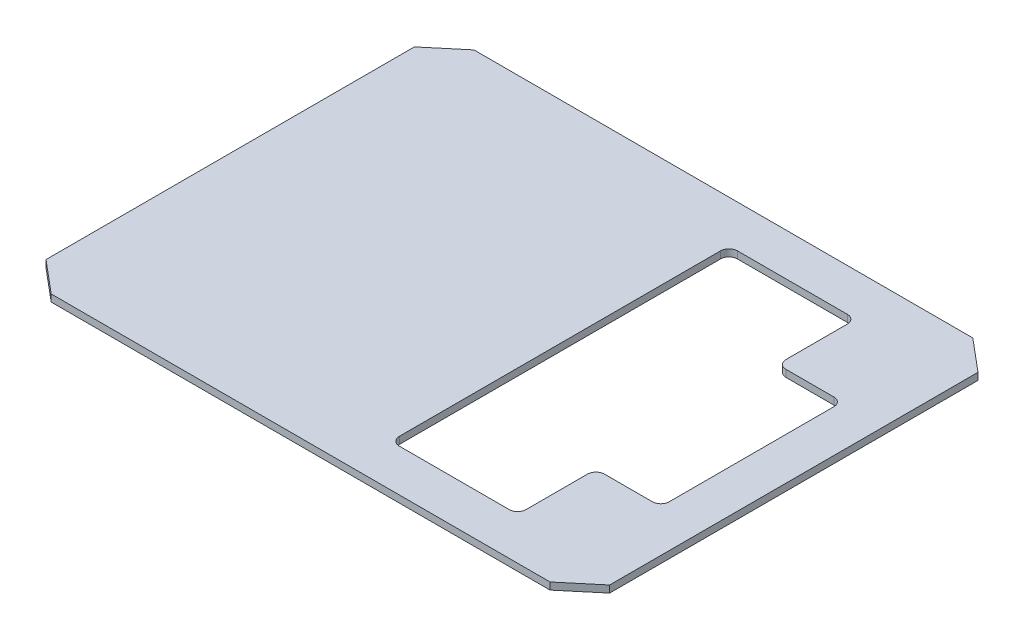
ISO-10303-21;
HEADER;
FILE_DESCRIPTION(('STEP AP214'),'2;1');
FILE_NAME('part.step','',(''),(''),'','','');
FILE_SCHEMA(('AUTOMOTIVE_DESIGN { 1 0 10303 214 1 1 1 1 }'));
ENDSEC;
DATA;
#1=APPLICATION_CONTEXT('core data for automotive mechanical design processes');
#2=APPLICATION_PROTOCOL_DEFINITION('international standard','automotive_design',2000,#1);
#3=PRODUCT_CONTEXT('',#1,'mechanical');
#4=PRODUCT('Part','Part','',(#3));
#5=PRODUCT_RELATED_PRODUCT_CATEGORY('part','',(#4));
#6=PRODUCT_DEFINITION_FORMATION('','',#4);
#7=PRODUCT_DEFINITION_CONTEXT('part definition',#1,'design');
#8=PRODUCT_DEFINITION('design','',#6,#7);
#9=PRODUCT_DEFINITION_SHAPE('','',#8);
#10=(LENGTH_UNIT() NAMED_UNIT(*) SI_UNIT(.MILLI.,.METRE.));
#11=(NAMED_UNIT(*) PLANE_ANGLE_UNIT() SI_UNIT($,.RADIAN.));
#12=(NAMED_UNIT(*) SI_UNIT($,.STERADIAN.) SOLID_ANGLE_UNIT());
#13=UNCERTAINTY_MEASURE_WITH_UNIT(LENGTH_MEASURE(1.E-05),#10,'distance_accuracy_value','');
#14=(GEOMETRIC_REPRESENTATION_CONTEXT(3) GLOBAL_UNCERTAINTY_ASSIGNED_CONTEXT((#13)) GLOBAL_UNIT_ASSIGNED_CONTEXT((#10,
#11,#12)) REPRESENTATION_CONTEXT('',''));
#15=CARTESIAN_POINT('',(0.,0.,0.));
#16=DIRECTION('',(0.,0.,1.));
#17=DIRECTION('',(1.,0.,0.));
#18=AXIS2_PLACEMENT_3D('',#15,#16,#17);
#19=CARTESIAN_POINT('',(127.,3.175,0.));
#20=DIRECTION('',(1.,0.,0.));
#21=DIRECTION('',(0.,0.,-1.));
#22=AXIS2_PLACEMENT_3D('',#19,#20,#21);
#23=PLANE('',#22);
#24=DIRECTION('',(0.,0.,1.));
#25=VECTOR('',#24,1.);
#26=CARTESIAN_POINT('',(127.,0.,0.));
#27=LINE('',#26,#25);
#28=CARTESIAN_POINT('',(127.,0.,-83.0048960354714));
#29=VERTEX_POINT('',#28);
#30=CARTESIAN_POINT('',(127.,0.,83.0048960354715));
#31=VERTEX_POINT('',#30);
#32=EDGE_CURVE('E299',#29,#31,#27,.T.);
#33=ORIENTED_EDGE('',*,*,#32,.F.);
#34=DIRECTION('',(0.,-1.,0.));
#35=VECTOR('',#34,1.);
#36=CARTESIAN_POINT('',(127.,3.175,-83.0048960354714));
#37=LINE('',#36,#35);
#38=CARTESIAN_POINT('',(127.,3.175,-83.0048960354714));
#39=VERTEX_POINT('',#38);
#40=EDGE_CURVE('E11',#39,#29,#37,.T.);
#41=ORIENTED_EDGE('',*,*,#40,.F.);
#42=DIRECTION('',(0.,0.,1.));
#43=VECTOR('',#42,1.);
#44=CARTESIAN_POINT('',(127.,3.175,0.));
#45=LINE('',#44,#43);
#46=CARTESIAN_POINT('',(127.,3.175,83.0048960354715));
#47=VERTEX_POINT('',#46);
#48=EDGE_CURVE('E327',#39,#47,#45,.T.);
#49=ORIENTED_EDGE('',*,*,#48,.T.);
#50=DIRECTION('',(0.,-1.,0.));
#51=VECTOR('',#50,1.);
#52=CARTESIAN_POINT('',(127.,3.175,83.0048960354715));
#53=LINE('',#52,#51);
#54=EDGE_CURVE('E350',#47,#31,#53,.T.);
#55=ORIENTED_EDGE('',*,*,#54,.T.);
#56=EDGE_LOOP('',(#33,#41,#49,#55));
#57=FACE_BOUND('',#56,.T.);
#58=ADVANCED_FACE('F35',(#57),#23,.T.);
#59=CARTESIAN_POINT('',(93.3452732950022,3.175,-111.244564801007));
#60=DIRECTION('',(-0.642787609686539,0.,0.766044443118978));
#61=DIRECTION('',(0.766044443118978,0.,0.642787609686539));
#62=AXIS2_PLACEMENT_3D('',#59,#60,#61);
#63=PLANE('',#62);
#64=DIRECTION('',(-0.766044443118978,0.,-0.642787609686539));
#65=VECTOR('',#64,1.);
#66=CARTESIAN_POINT('',(93.3452732950022,0.,-111.244564801007));
#67=LINE('',#66,#65);
#68=CARTESIAN_POINT('',(112.406853358583,0.,-95.25));
#69=VERTEX_POINT('',#68);
#70=EDGE_CURVE('E353',#29,#69,#67,.T.);
#71=ORIENTED_EDGE('',*,*,#70,.T.);
#72=DIRECTION('',(0.,-1.,0.));
#73=VECTOR('',#72,1.);
#74=CARTESIAN_POINT('',(112.406853358583,3.175,-95.25));
#75=LINE('',#74,#73);
#76=CARTESIAN_POINT('',(112.406853358583,3.175,-95.25));
#77=VERTEX_POINT('',#76);
#78=EDGE_CURVE('E42',#77,#69,#75,.T.);
#79=ORIENTED_EDGE('',*,*,#78,.F.);
#80=DIRECTION('',(-0.766044443118978,0.,-0.642787609686539));
#81=VECTOR('',#80,1.);
#82=CARTESIAN_POINT('',(93.3452732950022,3.175,-111.244564801007));
#83=LINE('',#82,#81);
#84=EDGE_CURVE('E330',#39,#77,#83,.T.);
#85=ORIENTED_EDGE('',*,*,#84,.F.);
#86=ORIENTED_EDGE('',*,*,#40,.T.);
#87=EDGE_LOOP('',(#71,#79,#85,#86));
#88=FACE_BOUND('',#87,.T.);
#89=ADVANCED_FACE('F391',(#88),#63,.F.);
#90=CARTESIAN_POINT('',(0.,3.175,-95.25));
#91=DIRECTION('',(0.,0.,-1.));
#92=DIRECTION('',(-1.,0.,0.));
#93=AXIS2_PLACEMENT_3D('',#90,#91,#92);
#94=PLANE('',#93);
#95=DIRECTION('',(1.,0.,0.));
#96=VECTOR('',#95,1.);
#97=CARTESIAN_POINT('',(0.,0.,-95.25));
#98=LINE('',#97,#96);
#99=CARTESIAN_POINT('',(-112.406853358583,0.,-95.25));
#100=VERTEX_POINT('',#99);
#101=EDGE_CURVE('E356',#100,#69,#98,.T.);
#102=ORIENTED_EDGE('',*,*,#101,.F.);
#103=DIRECTION('',(0.,-1.,0.));
#104=VECTOR('',#103,1.);
#105=CARTESIAN_POINT('',(-112.406853358583,3.175,-95.25));
#106=LINE('',#105,#104);
#107=CARTESIAN_POINT('',(-112.406853358583,3.175,-95.25));
#108=VERTEX_POINT('',#107);
#109=EDGE_CURVE('E382',#108,#100,#106,.T.);
#110=ORIENTED_EDGE('',*,*,#109,.F.);
#111=DIRECTION('',(1.,0.,0.));
#112=VECTOR('',#111,1.);
#113=CARTESIAN_POINT('',(0.,3.175,-95.25));
#114=LINE('',#113,#112);
#115=EDGE_CURVE('E333',#108,#77,#114,.T.);
#116=ORIENTED_EDGE('',*,*,#115,.T.);
#117=ORIENTED_EDGE('',*,*,#78,.T.);
#118=EDGE_LOOP('',(#102,#110,#116,#117));
#119=FACE_BOUND('',#118,.T.);
#120=ADVANCED_FACE('F386',(#119),#94,.T.);
#121=CARTESIAN_POINT('',(-93.3452732950022,3.175,-111.244564801007));
#122=DIRECTION('',(-0.642787609686539,0.,-0.766044443118978));
#123=DIRECTION('',(-0.766044443118978,0.,0.642787609686539));
#124=AXIS2_PLACEMENT_3D('',#121,#122,#123);
#125=PLANE('',#124);
#126=DIRECTION('',(0.766044443118978,0.,-0.642787609686539));
#127=VECTOR('',#126,1.);
#128=CARTESIAN_POINT('',(-93.3452732950022,0.,-111.244564801007));
#129=LINE('',#128,#127);
#130=CARTESIAN_POINT('',(-127.,0.,-83.0048960354714));
#131=VERTEX_POINT('',#130);
#132=EDGE_CURVE('E359',#131,#100,#129,.T.);
#133=ORIENTED_EDGE('',*,*,#132,.F.);
#134=DIRECTION('',(0.,-1.,0.));
#135=VECTOR('',#134,1.);
#136=CARTESIAN_POINT('',(-127.,3.175,-83.0048960354714));
#137=LINE('',#136,#135);
#138=CARTESIAN_POINT('',(-127.,3.175,-83.0048960354714));
#139=VERTEX_POINT('',#138);
#140=EDGE_CURVE('E380',#139,#131,#137,.T.);
#141=ORIENTED_EDGE('',*,*,#140,.F.);
#142=DIRECTION('',(0.766044443118978,0.,-0.642787609686539));
#143=VECTOR('',#142,1.);
#144=CARTESIAN_POINT('',(-93.3452732950022,3.175,-111.244564801007));
#145=LINE('',#144,#143);
#146=EDGE_CURVE('E336',#139,#108,#145,.T.);
#147=ORIENTED_EDGE('',*,*,#146,.T.);
#148=ORIENTED_EDGE('',*,*,#109,.T.);
#149=EDGE_LOOP('',(#133,#141,#147,#148));
#150=FACE_BOUND('',#149,.T.);
#151=ADVANCED_FACE('F397',(#150),#125,.T.);
#152=CARTESIAN_POINT('',(-127.,3.175,0.));
#153=DIRECTION('',(-1.,0.,0.));
#154=DIRECTION('',(0.,0.,1.));
#155=AXIS2_PLACEMENT_3D('',#152,#153,#154);
#156=PLANE('',#155);
#157=DIRECTION('',(0.,0.,-1.));
#158=VECTOR('',#157,1.);
#159=CARTESIAN_POINT('',(-127.,0.,0.));
#160=LINE('',#159,#158);
#161=CARTESIAN_POINT('',(-127.,0.,83.0048960354715));
#162=VERTEX_POINT('',#161);
#163=EDGE_CURVE('E362',#162,#131,#160,.T.);
#164=ORIENTED_EDGE('',*,*,#163,.F.);
#165=DIRECTION('',(0.,-1.,0.));
#166=VECTOR('',#165,1.);
#167=CARTESIAN_POINT('',(-127.,3.175,83.0048960354715));
#168=LINE('',#167,#166);
#169=CARTESIAN_POINT('',(-127.,3.175,83.0048960354715));
#170=VERTEX_POINT('',#169);
#171=EDGE_CURVE('E378',#170,#162,#168,.T.);
#172=ORIENTED_EDGE('',*,*,#171,.F.);
#173=DIRECTION('',(0.,0.,-1.));
#174=VECTOR('',#173,1.);
#175=CARTESIAN_POINT('',(-127.,3.175,0.));
#176=LINE('',#175,#174);
#177=EDGE_CURVE('E339',#170,#139,#176,.T.);
#178=ORIENTED_EDGE('',*,*,#177,.T.);
#179=ORIENTED_EDGE('',*,*,#140,.T.);
#180=EDGE_LOOP('',(#164,#172,#178,#179));
#181=FACE_BOUND('',#180,.T.);
#182=ADVANCED_FACE('F415',(#181),#156,.T.);
#183=CARTESIAN_POINT('',(-93.3452732950022,3.175,111.244564801007));
#184=DIRECTION('',(0.642787609686539,0.,-0.766044443118978));
#185=DIRECTION('',(-0.766044443118978,0.,-0.642787609686539));
#186=AXIS2_PLACEMENT_3D('',#183,#184,#185);
#187=PLANE('',#186);
#188=DIRECTION('',(0.766044443118978,0.,0.642787609686539));
#189=VECTOR('',#188,1.);
#190=CARTESIAN_POINT('',(-93.3452732950022,0.,111.244564801007));
#191=LINE('',#190,#189);
#192=CARTESIAN_POINT('',(-112.406853358583,0.,95.2500000000001));
#193=VERTEX_POINT('',#192);
#194=EDGE_CURVE('E365',#162,#193,#191,.T.);
#195=ORIENTED_EDGE('',*,*,#194,.T.);
#196=DIRECTION('',(0.,-1.,0.));
#197=VECTOR('',#196,1.);
#198=CARTESIAN_POINT('',(-112.406853358583,3.175,95.2500000000001));
#199=LINE('',#198,#197);
#200=CARTESIAN_POINT('',(-112.406853358583,3.175,95.2500000000001));
#201=VERTEX_POINT('',#200);
#202=EDGE_CURVE('E376',#201,#193,#199,.T.);
#203=ORIENTED_EDGE('',*,*,#202,.F.);
#204=DIRECTION('',(0.766044443118978,0.,0.642787609686539));
#205=VECTOR('',#204,1.);
#206=CARTESIAN_POINT('',(-93.3452732950022,3.175,111.244564801007));
#207=LINE('',#206,#205);
#208=EDGE_CURVE('E342',#170,#201,#207,.T.);
#209=ORIENTED_EDGE('',*,*,#208,.F.);
#210=ORIENTED_EDGE('',*,*,#171,.T.);
#211=EDGE_LOOP('',(#195,#203,#209,#210));
#212=FACE_BOUND('',#211,.T.);
#213=ADVANCED_FACE('F417',(#212),#187,.F.);
#214=CARTESIAN_POINT('',(0.,3.175,95.25));
#215=DIRECTION('',(0.,0.,1.));
#216=DIRECTION('',(1.,0.,0.));
#217=AXIS2_PLACEMENT_3D('',#214,#215,#216);
#218=PLANE('',#217);
#219=DIRECTION('',(-1.,0.,0.));
#220=VECTOR('',#219,1.);
#221=CARTESIAN_POINT('',(0.,0.,95.25));
#222=LINE('',#221,#220);
#223=CARTESIAN_POINT('',(112.406853358583,0.,95.2500000000001));
#224=VERTEX_POINT('',#223);
#225=EDGE_CURVE('E368',#224,#193,#222,.T.);
#226=ORIENTED_EDGE('',*,*,#225,.F.);
#227=DIRECTION('',(0.,-1.,0.));
#228=VECTOR('',#227,1.);
#229=CARTESIAN_POINT('',(112.406853358583,3.175,95.2500000000001));
#230=LINE('',#229,#228);
#231=CARTESIAN_POINT('',(112.406853358583,3.175,95.2500000000001));
#232=VERTEX_POINT('',#231);
#233=EDGE_CURVE('E374',#232,#224,#230,.T.);
#234=ORIENTED_EDGE('',*,*,#233,.F.);
#235=DIRECTION('',(-1.,0.,0.));
#236=VECTOR('',#235,1.);
#237=CARTESIAN_POINT('',(0.,3.175,95.25));
#238=LINE('',#237,#236);
#239=EDGE_CURVE('E344',#232,#201,#238,.T.);
#240=ORIENTED_EDGE('',*,*,#239,.T.);
#241=ORIENTED_EDGE('',*,*,#202,.T.);
#242=EDGE_LOOP('',(#226,#234,#240,#241));
#243=FACE_BOUND('',#242,.T.);
#244=ADVANCED_FACE('F411',(#243),#218,.T.);
#245=CARTESIAN_POINT('',(93.3452732950022,3.175,111.244564801007));
#246=DIRECTION('',(0.642787609686539,0.,0.766044443118978));
#247=DIRECTION('',(0.766044443118978,0.,-0.642787609686539));
#248=AXIS2_PLACEMENT_3D('',#245,#246,#247);
#249=PLANE('',#248);
#250=DIRECTION('',(-0.766044443118978,0.,0.642787609686539));
#251=VECTOR('',#250,1.);
#252=CARTESIAN_POINT('',(93.3452732950022,0.,111.244564801007));
#253=LINE('',#252,#251);
#254=EDGE_CURVE('E331',#31,#224,#253,.T.);
#255=ORIENTED_EDGE('',*,*,#254,.F.);
#256=ORIENTED_EDGE('',*,*,#54,.F.);
#257=DIRECTION('',(-0.766044443118978,0.,0.642787609686539));
#258=VECTOR('',#257,1.);
#259=CARTESIAN_POINT('',(93.3452732950022,3.175,111.244564801007));
#260=LINE('',#259,#258);
#261=EDGE_CURVE('E347',#47,#232,#260,.T.);
#262=ORIENTED_EDGE('',*,*,#261,.T.);
#263=ORIENTED_EDGE('',*,*,#233,.T.);
#264=EDGE_LOOP('',(#255,#256,#262,#263));
#265=FACE_BOUND('',#264,.T.);
#266=ADVANCED_FACE('F408',(#265),#249,.T.);
#267=CARTESIAN_POINT('',(0.,3.175,0.));
#268=DIRECTION('',(0.,1.,0.));
#269=DIRECTION('',(0.,0.,1.));
#270=AXIS2_PLACEMENT_3D('',#267,#268,#269);
#271=PLANE('',#270);
#272=CARTESIAN_POINT('',(104.14,3.175,-37.084));
#273=DIRECTION('',(0.,1.,0.));
#274=DIRECTION('',(0.,0.,-1.));
#275=AXIS2_PLACEMENT_3D('',#272,#273,#274);
#276=CIRCLE('',#275,3.81);
#277=CARTESIAN_POINT('',(107.95,3.175,-37.084));
#278=VERTEX_POINT('',#277);
#279=CARTESIAN_POINT('',(104.14,3.175,-40.894));
#280=VERTEX_POINT('',#279);
#281=EDGE_CURVE('E49',#278,#280,#276,.T.);
#282=ORIENTED_EDGE('',*,*,#281,.F.);
#283=DIRECTION('',(0.,0.,-1.));
#284=VECTOR('',#283,1.);
#285=CARTESIAN_POINT('',(107.95,3.175,-37.084));
#286=LINE('',#285,#284);
#287=CARTESIAN_POINT('',(107.95,3.175,37.084));
#288=VERTEX_POINT('',#287);
#289=EDGE_CURVE('E213',#288,#278,#286,.T.);
#290=ORIENTED_EDGE('',*,*,#289,.F.);
#291=CARTESIAN_POINT('',(104.14,3.175,37.084));
#292=DIRECTION('',(0.,1.,0.));
#293=DIRECTION('',(0.,0.,1.));
#294=AXIS2_PLACEMENT_3D('',#291,#292,#293);
#295=CIRCLE('',#294,3.81);
#296=CARTESIAN_POINT('',(104.14,3.175,40.894));
#297=VERTEX_POINT('',#296);
#298=EDGE_CURVE('E216',#297,#288,#295,.T.);
#299=ORIENTED_EDGE('',*,*,#298,.F.);
#300=DIRECTION('',(1.,0.,0.));
#301=VECTOR('',#300,1.);
#302=CARTESIAN_POINT('',(82.55,3.175,40.894));
#303=LINE('',#302,#301);
#304=CARTESIAN_POINT('',(82.55,3.175,40.894));
#305=VERTEX_POINT('',#304);
#306=EDGE_CURVE('E292',#305,#297,#303,.T.);
#307=ORIENTED_EDGE('',*,*,#306,.F.);
#308=CARTESIAN_POINT('',(82.55,3.175,44.704));
#309=DIRECTION('',(0.,-1.,0.));
#310=DIRECTION('',(0.,0.,1.));
#311=AXIS2_PLACEMENT_3D('',#308,#309,#310);
#312=CIRCLE('',#311,3.81);
#313=CARTESIAN_POINT('',(78.74,3.175,44.704));
#314=VERTEX_POINT('',#313);
#315=EDGE_CURVE('E289',#314,#305,#312,.T.);
#316=ORIENTED_EDGE('',*,*,#315,.F.);
#317=DIRECTION('',(0.,0.,-1.));
#318=VECTOR('',#317,1.);
#319=CARTESIAN_POINT('',(78.74,3.175,44.704));
#320=LINE('',#319,#318);
#321=CARTESIAN_POINT('',(78.74,3.175,72.39));
#322=VERTEX_POINT('',#321);
#323=EDGE_CURVE('E286',#322,#314,#320,.T.);
#324=ORIENTED_EDGE('',*,*,#323,.F.);
#325=CARTESIAN_POINT('',(74.93,3.175,72.39));
#326=DIRECTION('',(0.,1.,0.));
#327=DIRECTION('',(0.,0.,1.));
#328=AXIS2_PLACEMENT_3D('',#325,#326,#327);
#329=CIRCLE('',#328,3.80999999999999);
#330=CARTESIAN_POINT('',(74.93,3.175,76.2));
#331=VERTEX_POINT('',#330);
#332=EDGE_CURVE('E283',#331,#322,#329,.T.);
#333=ORIENTED_EDGE('',*,*,#332,.F.);
#334=DIRECTION('',(1.,0.,0.));
#335=VECTOR('',#334,1.);
#336=CARTESIAN_POINT('',(25.4,3.175,76.2));
#337=LINE('',#336,#335);
#338=CARTESIAN_POINT('',(25.4,3.175,76.2));
#339=VERTEX_POINT('',#338);
#340=EDGE_CURVE('E280',#339,#331,#337,.T.);
#341=ORIENTED_EDGE('',*,*,#340,.F.);
#342=CARTESIAN_POINT('',(25.4,3.175,72.39));
#343=DIRECTION('',(0.,1.,0.));
#344=DIRECTION('',(0.,0.,1.));
#345=AXIS2_PLACEMENT_3D('',#342,#343,#344);
#346=CIRCLE('',#345,3.81);
#347=CARTESIAN_POINT('',(21.59,3.175,72.39));
#348=VERTEX_POINT('',#347);
#349=EDGE_CURVE('E277',#348,#339,#346,.T.);
#350=ORIENTED_EDGE('',*,*,#349,.F.);
#351=DIRECTION('',(0.,0.,1.));
#352=VECTOR('',#351,1.);
#353=CARTESIAN_POINT('',(21.59,3.175,-72.39));
#354=LINE('',#353,#352);
#355=CARTESIAN_POINT('',(21.59,3.175,-72.39));
#356=VERTEX_POINT('',#355);
#357=EDGE_CURVE('E274',#356,#348,#354,.T.);
#358=ORIENTED_EDGE('',*,*,#357,.F.);
#359=CARTESIAN_POINT('',(25.4,3.175,-72.39));
#360=DIRECTION('',(0.,1.,0.));
#361=DIRECTION('',(0.,0.,1.));
#362=AXIS2_PLACEMENT_3D('',#359,#360,#361);
#363=CIRCLE('',#362,3.81);
#364=CARTESIAN_POINT('',(25.4,3.175,-76.2));
#365=VERTEX_POINT('',#364);
#366=EDGE_CURVE('E271',#365,#356,#363,.T.);
#367=ORIENTED_EDGE('',*,*,#366,.F.);
#368=DIRECTION('',(-1.,0.,0.));
#369=VECTOR('',#368,1.);
#370=CARTESIAN_POINT('',(25.4,3.175,-76.2));
#371=LINE('',#370,#369);
#372=CARTESIAN_POINT('',(74.9299999999999,3.175,-76.2));
#373=VERTEX_POINT('',#372);
#374=EDGE_CURVE('E268',#373,#365,#371,.T.);
#375=ORIENTED_EDGE('',*,*,#374,.F.);
#376=CARTESIAN_POINT('',(74.93,3.175,-72.39));
#377=DIRECTION('',(0.,1.,0.));
#378=DIRECTION('',(0.,0.,-1.));
#379=AXIS2_PLACEMENT_3D('',#376,#377,#378);
#380=CIRCLE('',#379,3.80999999999999);
#381=CARTESIAN_POINT('',(78.74,3.175,-72.39));
#382=VERTEX_POINT('',#381);
#383=EDGE_CURVE('E265',#382,#373,#380,.T.);
#384=ORIENTED_EDGE('',*,*,#383,.F.);
#385=DIRECTION('',(0.,0.,-1.));
#386=VECTOR('',#385,1.);
#387=CARTESIAN_POINT('',(78.74,3.175,-72.39));
#388=LINE('',#387,#386);
#389=CARTESIAN_POINT('',(78.74,3.175,-44.704));
#390=VERTEX_POINT('',#389);
#391=EDGE_CURVE('E262',#390,#382,#388,.T.);
#392=ORIENTED_EDGE('',*,*,#391,.F.);
#393=CARTESIAN_POINT('',(82.55,3.175,-44.704));
#394=DIRECTION('',(0.,-1.,0.));
#395=DIRECTION('',(0.,0.,-1.));
#396=AXIS2_PLACEMENT_3D('',#393,#394,#395);
#397=CIRCLE('',#396,3.81);
#398=CARTESIAN_POINT('',(82.55,3.175,-40.894));
#399=VERTEX_POINT('',#398);
#400=EDGE_CURVE('E259',#399,#390,#397,.T.);
#401=ORIENTED_EDGE('',*,*,#400,.F.);
#402=DIRECTION('',(-1.,0.,0.));
#403=VECTOR('',#402,1.);
#404=CARTESIAN_POINT('',(82.55,3.175,-40.894));
#405=LINE('',#404,#403);
#406=EDGE_CURVE('E257',#280,#399,#405,.T.);
#407=ORIENTED_EDGE('',*,*,#406,.F.);
#408=EDGE_LOOP('',(#282,#290,#299,#307,#316,#324,#333,#341,#350,#358,#367,#375,#384,#392,#401,#407));
#409=FACE_BOUND('',#408,.T.);
#410=ORIENTED_EDGE('',*,*,#48,.F.);
#411=ORIENTED_EDGE('',*,*,#84,.T.);
#412=ORIENTED_EDGE('',*,*,#115,.F.);
#413=ORIENTED_EDGE('',*,*,#146,.F.);
#414=ORIENTED_EDGE('',*,*,#177,.F.);
#415=ORIENTED_EDGE('',*,*,#208,.T.);
#416=ORIENTED_EDGE('',*,*,#239,.F.);
#417=ORIENTED_EDGE('',*,*,#261,.F.);
#418=EDGE_LOOP('',(#410,#411,#412,#413,#414,#415,#416,#417));
#419=FACE_BOUND('',#418,.T.);
#420=ADVANCED_FACE('F401',(#409,#419),#271,.T.);
#421=CARTESIAN_POINT('',(0.,0.,0.));
#422=DIRECTION('',(0.,1.,0.));
#423=DIRECTION('',(0.,0.,1.));
#424=AXIS2_PLACEMENT_3D('',#421,#422,#423);
#425=PLANE('',#424);
#426=DIRECTION('',(0.,0.,-1.));
#427=VECTOR('',#426,1.);
#428=CARTESIAN_POINT('',(107.95,0.,-37.084));
#429=LINE('',#428,#427);
#430=CARTESIAN_POINT('',(107.95,0.,37.084));
#431=VERTEX_POINT('',#430);
#432=CARTESIAN_POINT('',(107.95,0.,-37.084));
#433=VERTEX_POINT('',#432);
#434=EDGE_CURVE('E202',#431,#433,#429,.T.);
#435=ORIENTED_EDGE('',*,*,#434,.T.);
#436=CARTESIAN_POINT('',(104.14,0.,-37.084));
#437=DIRECTION('',(0.,1.,0.));
#438=DIRECTION('',(0.,0.,-1.));
#439=AXIS2_PLACEMENT_3D('',#436,#437,#438);
#440=CIRCLE('',#439,3.81);
#441=CARTESIAN_POINT('',(104.14,0.,-40.894));
#442=VERTEX_POINT('',#441);
#443=EDGE_CURVE('E196',#433,#442,#440,.T.);
#444=ORIENTED_EDGE('',*,*,#443,.T.);
#445=DIRECTION('',(-1.,0.,0.));
#446=VECTOR('',#445,1.);
#447=CARTESIAN_POINT('',(82.55,0.,-40.894));
#448=LINE('',#447,#446);
#449=CARTESIAN_POINT('',(82.55,0.,-40.894));
#450=VERTEX_POINT('',#449);
#451=EDGE_CURVE('E205',#442,#450,#448,.T.);
#452=ORIENTED_EDGE('',*,*,#451,.T.);
#453=CARTESIAN_POINT('',(82.55,0.,-44.704));
#454=DIRECTION('',(0.,-1.,0.));
#455=DIRECTION('',(0.,0.,-1.));
#456=AXIS2_PLACEMENT_3D('',#453,#454,#455);
#457=CIRCLE('',#456,3.81);
#458=CARTESIAN_POINT('',(78.74,0.,-44.704));
#459=VERTEX_POINT('',#458);
#460=EDGE_CURVE('E57',#450,#459,#457,.T.);
#461=ORIENTED_EDGE('',*,*,#460,.T.);
#462=DIRECTION('',(0.,0.,-1.));
#463=VECTOR('',#462,1.);
#464=CARTESIAN_POINT('',(78.74,0.,-72.39));
#465=LINE('',#464,#463);
#466=CARTESIAN_POINT('',(78.74,0.,-72.39));
#467=VERTEX_POINT('',#466);
#468=EDGE_CURVE('E220',#459,#467,#465,.T.);
#469=ORIENTED_EDGE('',*,*,#468,.T.);
#470=CARTESIAN_POINT('',(74.93,0.,-72.39));
#471=DIRECTION('',(0.,1.,0.));
#472=DIRECTION('',(0.,0.,-1.));
#473=AXIS2_PLACEMENT_3D('',#470,#471,#472);
#474=CIRCLE('',#473,3.80999999999999);
#475=CARTESIAN_POINT('',(74.9299999999999,0.,-76.2));
#476=VERTEX_POINT('',#475);
#477=EDGE_CURVE('E223',#467,#476,#474,.T.);
#478=ORIENTED_EDGE('',*,*,#477,.T.);
#479=DIRECTION('',(-1.,0.,0.));
#480=VECTOR('',#479,1.);
#481=CARTESIAN_POINT('',(25.4,0.,-76.2));
#482=LINE('',#481,#480);
#483=CARTESIAN_POINT('',(25.4,0.,-76.2));
#484=VERTEX_POINT('',#483);
#485=EDGE_CURVE('E226',#476,#484,#482,.T.);
#486=ORIENTED_EDGE('',*,*,#485,.T.);
#487=CARTESIAN_POINT('',(25.4,0.,-72.39));
#488=DIRECTION('',(0.,1.,0.));
#489=DIRECTION('',(0.,0.,1.));
#490=AXIS2_PLACEMENT_3D('',#487,#488,#489);
#491=CIRCLE('',#490,3.81);
#492=CARTESIAN_POINT('',(21.59,0.,-72.39));
#493=VERTEX_POINT('',#492);
#494=EDGE_CURVE('E229',#484,#493,#491,.T.);
#495=ORIENTED_EDGE('',*,*,#494,.T.);
#496=DIRECTION('',(0.,0.,1.));
#497=VECTOR('',#496,1.);
#498=CARTESIAN_POINT('',(21.59,0.,-72.39));
#499=LINE('',#498,#497);
#500=CARTESIAN_POINT('',(21.59,0.,72.39));
#501=VERTEX_POINT('',#500);
#502=EDGE_CURVE('E232',#493,#501,#499,.T.);
#503=ORIENTED_EDGE('',*,*,#502,.T.);
#504=CARTESIAN_POINT('',(25.4,0.,72.39));
#505=DIRECTION('',(0.,1.,0.));
#506=DIRECTION('',(0.,0.,1.));
#507=AXIS2_PLACEMENT_3D('',#504,#505,#506);
#508=CIRCLE('',#507,3.81);
#509=CARTESIAN_POINT('',(25.4,0.,76.2));
#510=VERTEX_POINT('',#509);
#511=EDGE_CURVE('E235',#501,#510,#508,.T.);
#512=ORIENTED_EDGE('',*,*,#511,.T.);
#513=DIRECTION('',(1.,0.,0.));
#514=VECTOR('',#513,1.);
#515=CARTESIAN_POINT('',(25.4,0.,76.2));
#516=LINE('',#515,#514);
#517=CARTESIAN_POINT('',(74.93,0.,76.2));
#518=VERTEX_POINT('',#517);
#519=EDGE_CURVE('E238',#510,#518,#516,.T.);
#520=ORIENTED_EDGE('',*,*,#519,.T.);
#521=CARTESIAN_POINT('',(74.93,0.,72.39));
#522=DIRECTION('',(0.,1.,0.));
#523=DIRECTION('',(0.,0.,1.));
#524=AXIS2_PLACEMENT_3D('',#521,#522,#523);
#525=CIRCLE('',#524,3.80999999999999);
#526=CARTESIAN_POINT('',(78.74,0.,72.39));
#527=VERTEX_POINT('',#526);
#528=EDGE_CURVE('E241',#518,#527,#525,.T.);
#529=ORIENTED_EDGE('',*,*,#528,.T.);
#530=DIRECTION('',(0.,0.,-1.));
#531=VECTOR('',#530,1.);
#532=CARTESIAN_POINT('',(78.74,0.,44.704));
#533=LINE('',#532,#531);
#534=CARTESIAN_POINT('',(78.74,0.,44.704));
#535=VERTEX_POINT('',#534);
#536=EDGE_CURVE('E244',#527,#535,#533,.T.);
#537=ORIENTED_EDGE('',*,*,#536,.T.);
#538=CARTESIAN_POINT('',(82.55,0.,44.704));
#539=DIRECTION('',(0.,-1.,0.));
#540=DIRECTION('',(0.,0.,1.));
#541=AXIS2_PLACEMENT_3D('',#538,#539,#540);
#542=CIRCLE('',#541,3.81);
#543=CARTESIAN_POINT('',(82.55,0.,40.894));
#544=VERTEX_POINT('',#543);
#545=EDGE_CURVE('E247',#535,#544,#542,.T.);
#546=ORIENTED_EDGE('',*,*,#545,.T.);
#547=DIRECTION('',(1.,0.,0.));
#548=VECTOR('',#547,1.);
#549=CARTESIAN_POINT('',(82.55,0.,40.894));
#550=LINE('',#549,#548);
#551=CARTESIAN_POINT('',(104.14,0.,40.894));
#552=VERTEX_POINT('',#551);
#553=EDGE_CURVE('E250',#544,#552,#550,.T.);
#554=ORIENTED_EDGE('',*,*,#553,.T.);
#555=CARTESIAN_POINT('',(104.14,0.,37.084));
#556=DIRECTION('',(0.,1.,0.));
#557=DIRECTION('',(0.,0.,1.));
#558=AXIS2_PLACEMENT_3D('',#555,#556,#557);
#559=CIRCLE('',#558,3.81);
#560=EDGE_CURVE('E253',#552,#431,#559,.T.);
#561=ORIENTED_EDGE('',*,*,#560,.T.);
#562=EDGE_LOOP('',(#435,#444,#452,#461,#469,#478,#486,#495,#503,#512,#520,#529,#537,#546,#554,#561));
#563=FACE_BOUND('',#562,.T.);
#564=ORIENTED_EDGE('',*,*,#32,.T.);
#565=ORIENTED_EDGE('',*,*,#254,.T.);
#566=ORIENTED_EDGE('',*,*,#225,.T.);
#567=ORIENTED_EDGE('',*,*,#194,.F.);
#568=ORIENTED_EDGE('',*,*,#163,.T.);
#569=ORIENTED_EDGE('',*,*,#132,.T.);
#570=ORIENTED_EDGE('',*,*,#101,.T.);
#571=ORIENTED_EDGE('',*,*,#70,.F.);
#572=EDGE_LOOP('',(#564,#565,#566,#567,#568,#569,#570,#571));
#573=FACE_BOUND('',#572,.T.);
#574=ADVANCED_FACE('F209',(#563,#573),#425,.F.);
#575=CARTESIAN_POINT('',(104.14,0.,-37.084));
#576=DIRECTION('',(0.,1.,0.));
#577=DIRECTION('',(0.,0.,1.));
#578=AXIS2_PLACEMENT_3D('',#575,#576,#577);
#579=CYLINDRICAL_SURFACE('',#578,3.81);
#580=ORIENTED_EDGE('',*,*,#281,.T.);
#581=DIRECTION('',(0.,1.,0.));
#582=VECTOR('',#581,1.);
#583=CARTESIAN_POINT('',(104.14,0.,-40.894));
#584=LINE('',#583,#582);
#585=EDGE_CURVE('E192',#442,#280,#584,.T.);
#586=ORIENTED_EDGE('',*,*,#585,.F.);
#587=ORIENTED_EDGE('',*,*,#443,.F.);
#588=DIRECTION('',(0.,1.,0.));
#589=VECTOR('',#588,1.);
#590=CARTESIAN_POINT('',(107.95,0.,-37.084));
#591=LINE('',#590,#589);
#592=EDGE_CURVE('E297',#433,#278,#591,.T.);
#593=ORIENTED_EDGE('',*,*,#592,.T.);
#594=EDGE_LOOP('',(#580,#586,#587,#593));
#595=FACE_BOUND('',#594,.T.);
#596=ADVANCED_FACE('F194',(#595),#579,.F.);
#597=CARTESIAN_POINT('',(107.95,0.,-37.084));
#598=DIRECTION('',(1.,0.,0.));
#599=DIRECTION('',(0.,0.,-1.));
#600=AXIS2_PLACEMENT_3D('',#597,#598,#599);
#601=PLANE('',#600);
#602=ORIENTED_EDGE('',*,*,#289,.T.);
#603=ORIENTED_EDGE('',*,*,#592,.F.);
#604=ORIENTED_EDGE('',*,*,#434,.F.);
#605=DIRECTION('',(0.,1.,0.));
#606=VECTOR('',#605,1.);
#607=CARTESIAN_POINT('',(107.95,0.,37.084));
#608=LINE('',#607,#606);
#609=EDGE_CURVE('E300',#431,#288,#608,.T.);
#610=ORIENTED_EDGE('',*,*,#609,.T.);
#611=EDGE_LOOP('',(#602,#603,#604,#610));
#612=FACE_BOUND('',#611,.T.);
#613=ADVANCED_FACE('F488',(#612),#601,.F.);
#614=CARTESIAN_POINT('',(104.14,0.,37.084));
#615=DIRECTION('',(0.,1.,0.));
#616=DIRECTION('',(0.,0.,1.));
#617=AXIS2_PLACEMENT_3D('',#614,#615,#616);
#618=CYLINDRICAL_SURFACE('',#617,3.81);
#619=ORIENTED_EDGE('',*,*,#298,.T.);
#620=ORIENTED_EDGE('',*,*,#609,.F.);
#621=ORIENTED_EDGE('',*,*,#560,.F.);
#622=DIRECTION('',(0.,1.,0.));
#623=VECTOR('',#622,1.);
#624=CARTESIAN_POINT('',(104.14,0.,40.894));
#625=LINE('',#624,#623);
#626=EDGE_CURVE('E302',#552,#297,#625,.T.);
#627=ORIENTED_EDGE('',*,*,#626,.T.);
#628=EDGE_LOOP('',(#619,#620,#621,#627));
#629=FACE_BOUND('',#628,.T.);
#630=ADVANCED_FACE('F497',(#629),#618,.F.);
#631=CARTESIAN_POINT('',(82.55,0.,40.894));
#632=DIRECTION('',(0.,0.,1.));
#633=DIRECTION('',(1.,0.,0.));
#634=AXIS2_PLACEMENT_3D('',#631,#632,#633);
#635=PLANE('',#634);
#636=ORIENTED_EDGE('',*,*,#306,.T.);
#637=ORIENTED_EDGE('',*,*,#626,.F.);
#638=ORIENTED_EDGE('',*,*,#553,.F.);
#639=DIRECTION('',(0.,1.,0.));
#640=VECTOR('',#639,1.);
#641=CARTESIAN_POINT('',(82.55,0.,40.894));
#642=LINE('',#641,#640);
#643=EDGE_CURVE('E304',#544,#305,#642,.T.);
#644=ORIENTED_EDGE('',*,*,#643,.T.);
#645=EDGE_LOOP('',(#636,#637,#638,#644));
#646=FACE_BOUND('',#645,.T.);
#647=ADVANCED_FACE('F507',(#646),#635,.F.);
#648=CARTESIAN_POINT('',(82.55,0.,44.704));
#649=DIRECTION('',(0.,1.,0.));
#650=DIRECTION('',(0.,0.,1.));
#651=AXIS2_PLACEMENT_3D('',#648,#649,#650);
#652=CYLINDRICAL_SURFACE('',#651,3.81);
#653=ORIENTED_EDGE('',*,*,#315,.T.);
#654=ORIENTED_EDGE('',*,*,#643,.F.);
#655=ORIENTED_EDGE('',*,*,#545,.F.);
#656=DIRECTION('',(0.,1.,0.));
#657=VECTOR('',#656,1.);
#658=CARTESIAN_POINT('',(78.74,0.,44.704));
#659=LINE('',#658,#657);
#660=EDGE_CURVE('E306',#535,#314,#659,.T.);
#661=ORIENTED_EDGE('',*,*,#660,.T.);
#662=EDGE_LOOP('',(#653,#654,#655,#661));
#663=FACE_BOUND('',#662,.T.);
#664=ADVANCED_FACE('F517',(#663),#652,.T.);
#665=CARTESIAN_POINT('',(78.74,0.,44.704));
#666=DIRECTION('',(1.,0.,0.));
#667=DIRECTION('',(0.,0.,-1.));
#668=AXIS2_PLACEMENT_3D('',#665,#666,#667);
#669=PLANE('',#668);
#670=ORIENTED_EDGE('',*,*,#323,.T.);
#671=ORIENTED_EDGE('',*,*,#660,.F.);
#672=ORIENTED_EDGE('',*,*,#536,.F.);
#673=DIRECTION('',(0.,1.,0.));
#674=VECTOR('',#673,1.);
#675=CARTESIAN_POINT('',(78.74,0.,72.39));
#676=LINE('',#675,#674);
#677=EDGE_CURVE('E308',#527,#322,#676,.T.);
#678=ORIENTED_EDGE('',*,*,#677,.T.);
#679=EDGE_LOOP('',(#670,#671,#672,#678));
#680=FACE_BOUND('',#679,.T.);
#681=ADVANCED_FACE('F527',(#680),#669,.F.);
#682=CARTESIAN_POINT('',(74.93,0.,72.39));
#683=DIRECTION('',(0.,1.,0.));
#684=DIRECTION('',(0.,0.,1.));
#685=AXIS2_PLACEMENT_3D('',#682,#683,#684);
#686=CYLINDRICAL_SURFACE('',#685,3.80999999999999);
#687=ORIENTED_EDGE('',*,*,#332,.T.);
#688=ORIENTED_EDGE('',*,*,#677,.F.);
#689=ORIENTED_EDGE('',*,*,#528,.F.);
#690=DIRECTION('',(0.,1.,0.));
#691=VECTOR('',#690,1.);
#692=CARTESIAN_POINT('',(74.93,0.,76.2));
#693=LINE('',#692,#691);
#694=EDGE_CURVE('E310',#518,#331,#693,.T.);
#695=ORIENTED_EDGE('',*,*,#694,.T.);
#696=EDGE_LOOP('',(#687,#688,#689,#695));
#697=FACE_BOUND('',#696,.T.);
#698=ADVANCED_FACE('F537',(#697),#686,.F.);
#699=CARTESIAN_POINT('',(25.4,0.,76.2));
#700=DIRECTION('',(0.,0.,1.));
#701=DIRECTION('',(1.,0.,0.));
#702=AXIS2_PLACEMENT_3D('',#699,#700,#701);
#703=PLANE('',#702);
#704=ORIENTED_EDGE('',*,*,#340,.T.);
#705=ORIENTED_EDGE('',*,*,#694,.F.);
#706=ORIENTED_EDGE('',*,*,#519,.F.);
#707=DIRECTION('',(0.,1.,0.));
#708=VECTOR('',#707,1.);
#709=CARTESIAN_POINT('',(25.4,0.,76.2));
#710=LINE('',#709,#708);
#711=EDGE_CURVE('E312',#510,#339,#710,.T.);
#712=ORIENTED_EDGE('',*,*,#711,.T.);
#713=EDGE_LOOP('',(#704,#705,#706,#712));
#714=FACE_BOUND('',#713,.T.);
#715=ADVANCED_FACE('F547',(#714),#703,.F.);
#716=CARTESIAN_POINT('',(25.4,0.,72.39));
#717=DIRECTION('',(0.,1.,0.));
#718=DIRECTION('',(0.,0.,1.));
#719=AXIS2_PLACEMENT_3D('',#716,#717,#718);
#720=CYLINDRICAL_SURFACE('',#719,3.81);
#721=ORIENTED_EDGE('',*,*,#349,.T.);
#722=ORIENTED_EDGE('',*,*,#711,.F.);
#723=ORIENTED_EDGE('',*,*,#511,.F.);
#724=DIRECTION('',(0.,1.,0.));
#725=VECTOR('',#724,1.);
#726=CARTESIAN_POINT('',(21.59,0.,72.39));
#727=LINE('',#726,#725);
#728=EDGE_CURVE('E314',#501,#348,#727,.T.);
#729=ORIENTED_EDGE('',*,*,#728,.T.);
#730=EDGE_LOOP('',(#721,#722,#723,#729));
#731=FACE_BOUND('',#730,.T.);
#732=ADVANCED_FACE('F557',(#731),#720,.F.);
#733=CARTESIAN_POINT('',(21.59,0.,-72.39));
#734=DIRECTION('',(-1.,0.,0.));
#735=DIRECTION('',(0.,0.,1.));
#736=AXIS2_PLACEMENT_3D('',#733,#734,#735);
#737=PLANE('',#736);
#738=ORIENTED_EDGE('',*,*,#357,.T.);
#739=ORIENTED_EDGE('',*,*,#728,.F.);
#740=ORIENTED_EDGE('',*,*,#502,.F.);
#741=DIRECTION('',(0.,1.,0.));
#742=VECTOR('',#741,1.);
#743=CARTESIAN_POINT('',(21.59,0.,-72.39));
#744=LINE('',#743,#742);
#745=EDGE_CURVE('E316',#493,#356,#744,.T.);
#746=ORIENTED_EDGE('',*,*,#745,.T.);
#747=EDGE_LOOP('',(#738,#739,#740,#746));
#748=FACE_BOUND('',#747,.T.);
#749=ADVANCED_FACE('F567',(#748),#737,.F.);
#750=CARTESIAN_POINT('',(25.4,0.,-72.39));
#751=DIRECTION('',(0.,1.,0.));
#752=DIRECTION('',(0.,0.,1.));
#753=AXIS2_PLACEMENT_3D('',#750,#751,#752);
#754=CYLINDRICAL_SURFACE('',#753,3.81);
#755=ORIENTED_EDGE('',*,*,#366,.T.);
#756=ORIENTED_EDGE('',*,*,#745,.F.);
#757=ORIENTED_EDGE('',*,*,#494,.F.);
#758=DIRECTION('',(0.,1.,0.));
#759=VECTOR('',#758,1.);
#760=CARTESIAN_POINT('',(25.4,0.,-76.2));
#761=LINE('',#760,#759);
#762=EDGE_CURVE('E318',#484,#365,#761,.T.);
#763=ORIENTED_EDGE('',*,*,#762,.T.);
#764=EDGE_LOOP('',(#755,#756,#757,#763));
#765=FACE_BOUND('',#764,.T.);
#766=ADVANCED_FACE('F577',(#765),#754,.F.);
#767=CARTESIAN_POINT('',(25.4,0.,-76.2));
#768=DIRECTION('',(0.,0.,-1.));
#769=DIRECTION('',(-1.,0.,0.));
#770=AXIS2_PLACEMENT_3D('',#767,#768,#769);
#771=PLANE('',#770);
#772=ORIENTED_EDGE('',*,*,#374,.T.);
#773=ORIENTED_EDGE('',*,*,#762,.F.);
#774=ORIENTED_EDGE('',*,*,#485,.F.);
#775=DIRECTION('',(0.,1.,0.));
#776=VECTOR('',#775,1.);
#777=CARTESIAN_POINT('',(74.9299999999999,0.,-76.2));
#778=LINE('',#777,#776);
#779=EDGE_CURVE('E320',#476,#373,#778,.T.);
#780=ORIENTED_EDGE('',*,*,#779,.T.);
#781=EDGE_LOOP('',(#772,#773,#774,#780));
#782=FACE_BOUND('',#781,.T.);
#783=ADVANCED_FACE('F587',(#782),#771,.F.);
#784=CARTESIAN_POINT('',(74.93,0.,-72.39));
#785=DIRECTION('',(0.,1.,0.));
#786=DIRECTION('',(0.,0.,1.));
#787=AXIS2_PLACEMENT_3D('',#784,#785,#786);
#788=CYLINDRICAL_SURFACE('',#787,3.80999999999999);
#789=ORIENTED_EDGE('',*,*,#383,.T.);
#790=ORIENTED_EDGE('',*,*,#779,.F.);
#791=ORIENTED_EDGE('',*,*,#477,.F.);
#792=DIRECTION('',(0.,1.,0.));
#793=VECTOR('',#792,1.);
#794=CARTESIAN_POINT('',(78.74,0.,-72.39));
#795=LINE('',#794,#793);
#796=EDGE_CURVE('E322',#467,#382,#795,.T.);
#797=ORIENTED_EDGE('',*,*,#796,.T.);
#798=EDGE_LOOP('',(#789,#790,#791,#797));
#799=FACE_BOUND('',#798,.T.);
#800=ADVANCED_FACE('F597',(#799),#788,.F.);
#801=CARTESIAN_POINT('',(78.74,0.,-72.39));
#802=DIRECTION('',(1.,0.,0.));
#803=DIRECTION('',(0.,0.,-1.));
#804=AXIS2_PLACEMENT_3D('',#801,#802,#803);
#805=PLANE('',#804);
#806=ORIENTED_EDGE('',*,*,#391,.T.);
#807=ORIENTED_EDGE('',*,*,#796,.F.);
#808=ORIENTED_EDGE('',*,*,#468,.F.);
#809=DIRECTION('',(0.,1.,0.));
#810=VECTOR('',#809,1.);
#811=CARTESIAN_POINT('',(78.74,0.,-44.704));
#812=LINE('',#811,#810);
#813=EDGE_CURVE('E324',#459,#390,#812,.T.);
#814=ORIENTED_EDGE('',*,*,#813,.T.);
#815=EDGE_LOOP('',(#806,#807,#808,#814));
#816=FACE_BOUND('',#815,.T.);
#817=ADVANCED_FACE('F607',(#816),#805,.F.);
#818=CARTESIAN_POINT('',(82.55,0.,-44.704));
#819=DIRECTION('',(0.,1.,0.));
#820=DIRECTION('',(0.,0.,1.));
#821=AXIS2_PLACEMENT_3D('',#818,#819,#820);
#822=CYLINDRICAL_SURFACE('',#821,3.81);
#823=ORIENTED_EDGE('',*,*,#400,.T.);
#824=ORIENTED_EDGE('',*,*,#813,.F.);
#825=ORIENTED_EDGE('',*,*,#460,.F.);
#826=DIRECTION('',(0.,1.,0.));
#827=VECTOR('',#826,1.);
#828=CARTESIAN_POINT('',(82.55,0.,-40.894));
#829=LINE('',#828,#827);
#830=EDGE_CURVE('E201',#450,#399,#829,.T.);
#831=ORIENTED_EDGE('',*,*,#830,.T.);
#832=EDGE_LOOP('',(#823,#824,#825,#831));
#833=FACE_BOUND('',#832,.T.);
#834=ADVANCED_FACE('F617',(#833),#822,.T.);
#835=CARTESIAN_POINT('',(82.55,0.,-40.894));
#836=DIRECTION('',(0.,0.,-1.));
#837=DIRECTION('',(-1.,0.,0.));
#838=AXIS2_PLACEMENT_3D('',#835,#836,#837);
#839=PLANE('',#838);
#840=ORIENTED_EDGE('',*,*,#406,.T.);
#841=ORIENTED_EDGE('',*,*,#830,.F.);
#842=ORIENTED_EDGE('',*,*,#451,.F.);
#843=ORIENTED_EDGE('',*,*,#585,.T.);
#844=EDGE_LOOP('',(#840,#841,#842,#843));
#845=FACE_BOUND('',#844,.T.);
#846=ADVANCED_FACE('F206',(#845),#839,.F.);
#847=CLOSED_SHELL('',(#58,#89,#120,#151,#182,#213,#244,#266,#420,#574,#596,#613,#630,#647,#664,
#681,#698,#715,#732,#749,#766,#783,#800,#817,#834,#846));
#848=MANIFOLD_SOLID_BREP('B2',#847);
#849=ADVANCED_BREP_SHAPE_REPRESENTATION('',(#18,#848),#14);
#850=SHAPE_DEFINITION_REPRESENTATION(#9,#849);
ENDSEC;
END-ISO-10303-21;
